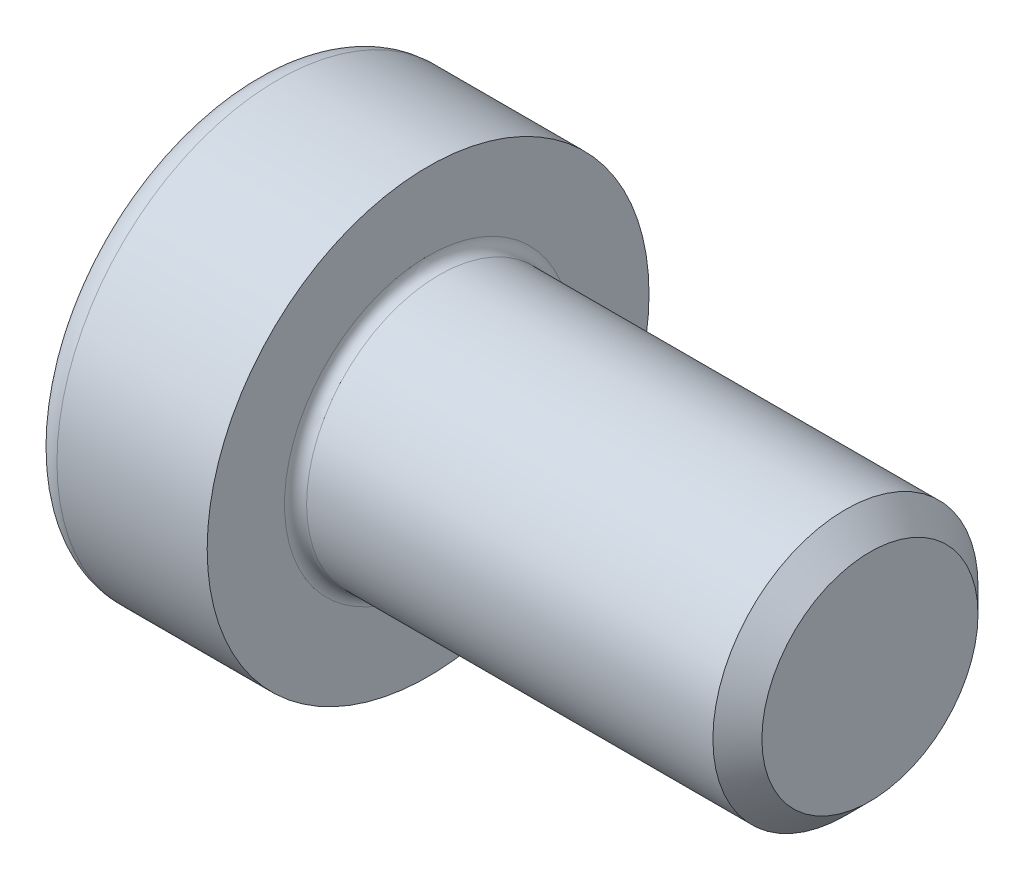
ISO-10303-21;
HEADER;
FILE_DESCRIPTION(('STEP AP214'),'2;1');
FILE_NAME('part.step','',(''),(''),'','','');
FILE_SCHEMA(('AUTOMOTIVE_DESIGN { 1 0 10303 214 1 1 1 1 }'));
ENDSEC;
DATA;
#1=APPLICATION_CONTEXT('core data for automotive mechanical design processes');
#2=APPLICATION_PROTOCOL_DEFINITION('international standard','automotive_design',2000,#1);
#3=PRODUCT_CONTEXT('',#1,'mechanical');
#4=PRODUCT('Part','Part','',(#3));
#5=PRODUCT_RELATED_PRODUCT_CATEGORY('part','',(#4));
#6=PRODUCT_DEFINITION_FORMATION('','',#4);
#7=PRODUCT_DEFINITION_CONTEXT('part definition',#1,'design');
#8=PRODUCT_DEFINITION('design','',#6,#7);
#9=PRODUCT_DEFINITION_SHAPE('','',#8);
#10=(LENGTH_UNIT() NAMED_UNIT(*) SI_UNIT(.MILLI.,.METRE.));
#11=(NAMED_UNIT(*) PLANE_ANGLE_UNIT() SI_UNIT($,.RADIAN.));
#12=(NAMED_UNIT(*) SI_UNIT($,.STERADIAN.) SOLID_ANGLE_UNIT());
#13=UNCERTAINTY_MEASURE_WITH_UNIT(LENGTH_MEASURE(1.E-05),#10,'distance_accuracy_value','');
#14=(GEOMETRIC_REPRESENTATION_CONTEXT(3) GLOBAL_UNCERTAINTY_ASSIGNED_CONTEXT((#13)) GLOBAL_UNIT_ASSIGNED_CONTEXT((#10,
#11,#12)) REPRESENTATION_CONTEXT('',''));
#15=CARTESIAN_POINT('',(0.,0.,0.));
#16=DIRECTION('',(0.,0.,1.));
#17=DIRECTION('',(1.,0.,0.));
#18=AXIS2_PLACEMENT_3D('',#15,#16,#17);
#19=CARTESIAN_POINT('',(0.,0.,0.));
#20=DIRECTION('',(-1.,0.,0.));
#21=DIRECTION('',(0.,0.,1.));
#22=AXIS2_PLACEMENT_3D('',#19,#20,#21);
#23=PLANE('',#22);
#24=DIRECTION('',(0.,-0.499999999999997,0.86602540378444));
#25=VECTOR('',#24,1.);
#26=CARTESIAN_POINT('',(0.,2.30940107675851,0.));
#27=LINE('',#26,#25);
#28=CARTESIAN_POINT('',(0.,2.30940107675851,0.));
#29=VERTEX_POINT('',#28);
#30=CARTESIAN_POINT('',(0.,1.15470053837926,1.99999999999999));
#31=VERTEX_POINT('',#30);
#32=EDGE_CURVE('E265',#29,#31,#27,.T.);
#33=ORIENTED_EDGE('',*,*,#32,.T.);
#34=DIRECTION('',(0.,1.,0.));
#35=VECTOR('',#34,1.);
#36=CARTESIAN_POINT('',(0.,-1.15470053837924,2.));
#37=LINE('',#36,#35);
#38=CARTESIAN_POINT('',(0.,-1.15470053837924,2.));
#39=VERTEX_POINT('',#38);
#40=EDGE_CURVE('E126',#39,#31,#37,.T.);
#41=ORIENTED_EDGE('',*,*,#40,.F.);
#42=DIRECTION('',(0.,-0.500000000000001,-0.866025403784438));
#43=VECTOR('',#42,1.);
#44=CARTESIAN_POINT('',(0.,-1.15470053837924,2.));
#45=LINE('',#44,#43);
#46=CARTESIAN_POINT('',(0.,-2.30940107675849,0.));
#47=VERTEX_POINT('',#46);
#48=EDGE_CURVE('E268',#39,#47,#45,.T.);
#49=ORIENTED_EDGE('',*,*,#48,.T.);
#50=DIRECTION('',(0.,0.499999999999997,-0.86602540378444));
#51=VECTOR('',#50,1.);
#52=CARTESIAN_POINT('',(0.,-2.30940107675849,0.));
#53=LINE('',#52,#51);
#54=CARTESIAN_POINT('',(0.,-1.15470053837925,-2.));
#55=VERTEX_POINT('',#54);
#56=EDGE_CURVE('E271',#47,#55,#53,.T.);
#57=ORIENTED_EDGE('',*,*,#56,.T.);
#58=DIRECTION('',(0.,-1.,0.));
#59=VECTOR('',#58,1.);
#60=CARTESIAN_POINT('',(0.,1.15470053837925,-2.00000000000001));
#61=LINE('',#60,#59);
#62=CARTESIAN_POINT('',(0.,1.15470053837925,-2.00000000000001));
#63=VERTEX_POINT('',#62);
#64=EDGE_CURVE('E274',#63,#55,#61,.T.);
#65=ORIENTED_EDGE('',*,*,#64,.F.);
#66=DIRECTION('',(0.,-0.500000000000001,-0.866025403784438));
#67=VECTOR('',#66,1.);
#68=CARTESIAN_POINT('',(0.,2.30940107675851,0.));
#69=LINE('',#68,#67);
#70=EDGE_CURVE('E121',#29,#63,#69,.T.);
#71=ORIENTED_EDGE('',*,*,#70,.F.);
#72=EDGE_LOOP('',(#33,#41,#49,#57,#65,#71));
#73=FACE_BOUND('',#72,.T.);
#74=CARTESIAN_POINT('',(0.,0.,0.));
#75=DIRECTION('',(-1.,0.,0.));
#76=DIRECTION('',(0.,0.,1.));
#77=AXIS2_PLACEMENT_3D('',#74,#75,#76);
#78=CIRCLE('',#77,4.4);
#79=CARTESIAN_POINT('',(0.,0.,4.4));
#80=VERTEX_POINT('',#79);
#81=EDGE_CURVE('E42',#80,#80,#78,.T.);
#82=ORIENTED_EDGE('',*,*,#81,.T.);
#83=EDGE_LOOP('',(#82));
#84=FACE_BOUND('',#83,.T.);
#85=ADVANCED_FACE('F34',(#73,#84),#23,.T.);
#86=CARTESIAN_POINT('',(-31.75,0.,0.));
#87=DIRECTION('',(-1.,0.,0.));
#88=DIRECTION('',(0.,0.,1.));
#89=AXIS2_PLACEMENT_3D('',#86,#87,#88);
#90=CYLINDRICAL_SURFACE('',#89,5.);
#91=CARTESIAN_POINT('',(0.600000000000003,0.,0.));
#92=DIRECTION('',(-1.,0.,0.));
#93=DIRECTION('',(0.,0.,1.));
#94=AXIS2_PLACEMENT_3D('',#91,#92,#93);
#95=CIRCLE('',#94,5.);
#96=CARTESIAN_POINT('',(0.600000000000003,0.,5.));
#97=VERTEX_POINT('',#96);
#98=EDGE_CURVE('E11',#97,#97,#95,.F.);
#99=ORIENTED_EDGE('',*,*,#98,.T.);
#100=EDGE_LOOP('',(#99));
#101=FACE_BOUND('',#100,.T.);
#102=CARTESIAN_POINT('',(4.,0.,0.));
#103=DIRECTION('',(-1.,0.,0.));
#104=DIRECTION('',(0.,0.,1.));
#105=AXIS2_PLACEMENT_3D('',#102,#103,#104);
#106=CIRCLE('',#105,5.);
#107=CARTESIAN_POINT('',(4.,0.,5.));
#108=VERTEX_POINT('',#107);
#109=EDGE_CURVE('E144',#108,#108,#106,.T.);
#110=ORIENTED_EDGE('',*,*,#109,.T.);
#111=EDGE_LOOP('',(#110));
#112=FACE_BOUND('',#111,.T.);
#113=ADVANCED_FACE('F168',(#101,#112),#90,.T.);
#114=CARTESIAN_POINT('',(4.,5.,0.));
#115=DIRECTION('',(1.,0.,0.));
#116=DIRECTION('',(0.,0.,-1.));
#117=AXIS2_PLACEMENT_3D('',#114,#115,#116);
#118=PLANE('',#117);
#119=CARTESIAN_POINT('',(4.,0.,0.));
#120=DIRECTION('',(1.,0.,0.));
#121=DIRECTION('',(0.,0.,-1.));
#122=AXIS2_PLACEMENT_3D('',#119,#120,#121);
#123=CIRCLE('',#122,3.24999999999998);
#124=CARTESIAN_POINT('',(4.,0.,-3.24999999999998));
#125=VERTEX_POINT('',#124);
#126=EDGE_CURVE('E147',#125,#125,#123,.F.);
#127=ORIENTED_EDGE('',*,*,#126,.T.);
#128=EDGE_LOOP('',(#127));
#129=FACE_BOUND('',#128,.T.);
#130=ORIENTED_EDGE('',*,*,#109,.F.);
#131=EDGE_LOOP('',(#130));
#132=FACE_BOUND('',#131,.T.);
#133=ADVANCED_FACE('F174',(#129,#132),#118,.T.);
#134=CARTESIAN_POINT('',(-31.75,0.,0.));
#135=DIRECTION('',(-1.,0.,0.));
#136=DIRECTION('',(0.,0.,1.));
#137=AXIS2_PLACEMENT_3D('',#134,#135,#136);
#138=CYLINDRICAL_SURFACE('',#137,2.99999999999998);
#139=CARTESIAN_POINT('',(4.25,0.,0.));
#140=DIRECTION('',(1.,0.,0.));
#141=DIRECTION('',(0.,0.,-1.));
#142=AXIS2_PLACEMENT_3D('',#139,#140,#141);
#143=CIRCLE('',#142,2.99999999999998);
#144=CARTESIAN_POINT('',(4.25,0.,-2.99999999999998));
#145=VERTEX_POINT('',#144);
#146=EDGE_CURVE('E150',#145,#145,#143,.T.);
#147=ORIENTED_EDGE('',*,*,#146,.T.);
#148=EDGE_LOOP('',(#147));
#149=FACE_BOUND('',#148,.T.);
#150=CARTESIAN_POINT('',(13.4455,0.,0.));
#151=DIRECTION('',(-1.,0.,0.));
#152=DIRECTION('',(0.,0.,1.));
#153=AXIS2_PLACEMENT_3D('',#150,#151,#152);
#154=CIRCLE('',#153,2.99999999999997);
#155=CARTESIAN_POINT('',(13.4455,0.,2.99999999999997));
#156=VERTEX_POINT('',#155);
#157=EDGE_CURVE('E141',#156,#156,#154,.T.);
#158=ORIENTED_EDGE('',*,*,#157,.T.);
#159=EDGE_LOOP('',(#158));
#160=FACE_BOUND('',#159,.T.);
#161=ADVANCED_FACE('F180',(#149,#160),#138,.T.);
#162=CARTESIAN_POINT('',(14.,0.,0.));
#163=DIRECTION('',(-1.,0.,0.));
#164=DIRECTION('',(0.,0.,1.));
#165=AXIS2_PLACEMENT_3D('',#162,#163,#164);
#166=CONICAL_SURFACE('',#165,2.4455,0.785398163397394);
#167=ORIENTED_EDGE('',*,*,#157,.F.);
#168=EDGE_LOOP('',(#167));
#169=FACE_BOUND('',#168,.T.);
#170=CARTESIAN_POINT('',(14.,0.,0.));
#171=DIRECTION('',(-1.,0.,0.));
#172=DIRECTION('',(0.,0.,1.));
#173=AXIS2_PLACEMENT_3D('',#170,#171,#172);
#174=CIRCLE('',#173,2.4455);
#175=CARTESIAN_POINT('',(14.,0.,2.4455));
#176=VERTEX_POINT('',#175);
#177=EDGE_CURVE('E137',#176,#176,#174,.T.);
#178=ORIENTED_EDGE('',*,*,#177,.T.);
#179=EDGE_LOOP('',(#178));
#180=FACE_BOUND('',#179,.T.);
#181=ADVANCED_FACE('F184',(#169,#180),#166,.T.);
#182=CARTESIAN_POINT('',(14.,2.4455,0.));
#183=DIRECTION('',(1.,0.,0.));
#184=DIRECTION('',(0.,0.,-1.));
#185=AXIS2_PLACEMENT_3D('',#182,#183,#184);
#186=PLANE('',#185);
#187=ORIENTED_EDGE('',*,*,#177,.F.);
#188=EDGE_LOOP('',(#187));
#189=FACE_BOUND('',#188,.T.);
#190=ADVANCED_FACE('F164',(#189),#186,.T.);
#191=CARTESIAN_POINT('',(4.25,0.,0.));
#192=DIRECTION('',(1.,0.,0.));
#193=DIRECTION('',(0.,0.,-1.));
#194=AXIS2_PLACEMENT_3D('',#191,#192,#193);
#195=TOROIDAL_SURFACE('',#194,3.24999999999998,0.25);
#196=ORIENTED_EDGE('',*,*,#146,.F.);
#197=EDGE_LOOP('',(#196));
#198=FACE_BOUND('',#197,.T.);
#199=ORIENTED_EDGE('',*,*,#126,.F.);
#200=EDGE_LOOP('',(#199));
#201=FACE_BOUND('',#200,.T.);
#202=ADVANCED_FACE('F157',(#198,#201),#195,.F.);
#203=CARTESIAN_POINT('',(0.600000000000003,0.,0.));
#204=DIRECTION('',(-1.,0.,0.));
#205=DIRECTION('',(0.,0.,1.));
#206=AXIS2_PLACEMENT_3D('',#203,#204,#205);
#207=TOROIDAL_SURFACE('',#206,4.4,0.6);
#208=ORIENTED_EDGE('',*,*,#98,.F.);
#209=EDGE_LOOP('',(#208));
#210=FACE_BOUND('',#209,.T.);
#211=ORIENTED_EDGE('',*,*,#81,.F.);
#212=EDGE_LOOP('',(#211));
#213=FACE_BOUND('',#212,.T.);
#214=ADVANCED_FACE('F36',(#210,#213),#207,.T.);
#215=CARTESIAN_POINT('',(3.,2.30940107675851,0.));
#216=DIRECTION('',(0.,-0.86602540378444,-0.499999999999998));
#217=DIRECTION('',(0.,0.499999999999998,-0.86602540378444));
#218=AXIS2_PLACEMENT_3D('',#215,#216,#217);
#219=PLANE('',#218);
#220=ORIENTED_EDGE('',*,*,#32,.F.);
#221=DIRECTION('',(-1.,0.,0.));
#222=VECTOR('',#221,1.);
#223=CARTESIAN_POINT('',(3.,2.30940107675851,0.));
#224=LINE('',#223,#222);
#225=CARTESIAN_POINT('',(3.,2.30940107675851,0.));
#226=VERTEX_POINT('',#225);
#227=EDGE_CURVE('E264',#226,#29,#224,.T.);
#228=ORIENTED_EDGE('',*,*,#227,.F.);
#229=DIRECTION('',(0.,-0.499999999999997,0.86602540378444));
#230=VECTOR('',#229,1.);
#231=CARTESIAN_POINT('',(3.,2.30940107675851,0.));
#232=LINE('',#231,#230);
#233=CARTESIAN_POINT('',(3.,1.73205080756888,0.999999999999995));
#234=VERTEX_POINT('',#233);
#235=EDGE_CURVE('E49',#226,#234,#232,.T.);
#236=ORIENTED_EDGE('',*,*,#235,.T.);
#237=CARTESIAN_POINT('',(3.,1.15470053837926,1.99999999999999));
#238=VERTEX_POINT('',#237);
#239=EDGE_CURVE('E107',#234,#238,#232,.T.);
#240=ORIENTED_EDGE('',*,*,#239,.T.);
#241=DIRECTION('',(-1.,0.,0.));
#242=VECTOR('',#241,1.);
#243=CARTESIAN_POINT('',(3.,1.15470053837926,1.99999999999999));
#244=LINE('',#243,#242);
#245=EDGE_CURVE('E119',#238,#31,#244,.T.);
#246=ORIENTED_EDGE('',*,*,#245,.T.);
#247=EDGE_LOOP('',(#220,#228,#236,#240,#246));
#248=FACE_BOUND('',#247,.T.);
#249=ADVANCED_FACE('F118',(#248),#219,.T.);
#250=CARTESIAN_POINT('',(3.,-1.15470053837924,2.));
#251=DIRECTION('',(0.,0.,1.));
#252=DIRECTION('',(0.,-1.,0.));
#253=AXIS2_PLACEMENT_3D('',#250,#251,#252);
#254=PLANE('',#253);
#255=ORIENTED_EDGE('',*,*,#40,.T.);
#256=ORIENTED_EDGE('',*,*,#245,.F.);
#257=DIRECTION('',(0.,1.,0.));
#258=VECTOR('',#257,1.);
#259=CARTESIAN_POINT('',(3.,-1.15470053837924,2.));
#260=LINE('',#259,#258);
#261=CARTESIAN_POINT('',(3.,0.,2.));
#262=VERTEX_POINT('',#261);
#263=EDGE_CURVE('E105',#262,#238,#260,.T.);
#264=ORIENTED_EDGE('',*,*,#263,.F.);
#265=CARTESIAN_POINT('',(3.,-1.15470053837924,2.));
#266=VERTEX_POINT('',#265);
#267=EDGE_CURVE('E115',#266,#262,#260,.T.);
#268=ORIENTED_EDGE('',*,*,#267,.F.);
#269=DIRECTION('',(-1.,0.,0.));
#270=VECTOR('',#269,1.);
#271=CARTESIAN_POINT('',(3.,-1.15470053837924,2.));
#272=LINE('',#271,#270);
#273=EDGE_CURVE('E128',#266,#39,#272,.T.);
#274=ORIENTED_EDGE('',*,*,#273,.T.);
#275=EDGE_LOOP('',(#255,#256,#264,#268,#274));
#276=FACE_BOUND('',#275,.T.);
#277=ADVANCED_FACE('F123',(#276),#254,.F.);
#278=CARTESIAN_POINT('',(3.,-1.15470053837924,2.));
#279=DIRECTION('',(0.,0.866025403784438,-0.500000000000001));
#280=DIRECTION('',(0.,0.500000000000001,0.866025403784438));
#281=AXIS2_PLACEMENT_3D('',#278,#279,#280);
#282=PLANE('',#281);
#283=ORIENTED_EDGE('',*,*,#48,.F.);
#284=ORIENTED_EDGE('',*,*,#273,.F.);
#285=DIRECTION('',(0.,-0.500000000000001,-0.866025403784438));
#286=VECTOR('',#285,1.);
#287=CARTESIAN_POINT('',(3.,-1.15470053837924,2.));
#288=LINE('',#287,#286);
#289=CARTESIAN_POINT('',(3.,-1.73205080756887,0.999999999999997));
#290=VERTEX_POINT('',#289);
#291=EDGE_CURVE('E245',#266,#290,#288,.T.);
#292=ORIENTED_EDGE('',*,*,#291,.T.);
#293=CARTESIAN_POINT('',(3.,-2.30940107675849,0.));
#294=VERTEX_POINT('',#293);
#295=EDGE_CURVE('E247',#290,#294,#288,.T.);
#296=ORIENTED_EDGE('',*,*,#295,.T.);
#297=DIRECTION('',(-1.,0.,0.));
#298=VECTOR('',#297,1.);
#299=CARTESIAN_POINT('',(3.,-2.30940107675849,0.));
#300=LINE('',#299,#298);
#301=EDGE_CURVE('E133',#294,#47,#300,.T.);
#302=ORIENTED_EDGE('',*,*,#301,.T.);
#303=EDGE_LOOP('',(#283,#284,#292,#296,#302));
#304=FACE_BOUND('',#303,.T.);
#305=ADVANCED_FACE('F197',(#304),#282,.T.);
#306=CARTESIAN_POINT('',(3.,-2.30940107675849,0.));
#307=DIRECTION('',(0.,0.86602540378444,0.499999999999998));
#308=DIRECTION('',(0.,-0.499999999999998,0.86602540378444));
#309=AXIS2_PLACEMENT_3D('',#306,#307,#308);
#310=PLANE('',#309);
#311=ORIENTED_EDGE('',*,*,#56,.F.);
#312=ORIENTED_EDGE('',*,*,#301,.F.);
#313=DIRECTION('',(0.,0.499999999999997,-0.86602540378444));
#314=VECTOR('',#313,1.);
#315=CARTESIAN_POINT('',(3.,-2.30940107675849,0.));
#316=LINE('',#315,#314);
#317=CARTESIAN_POINT('',(3.,-1.73205080756888,-0.999999999999993));
#318=VERTEX_POINT('',#317);
#319=EDGE_CURVE('E250',#294,#318,#316,.T.);
#320=ORIENTED_EDGE('',*,*,#319,.T.);
#321=CARTESIAN_POINT('',(3.,-1.15470053837925,-2.));
#322=VERTEX_POINT('',#321);
#323=EDGE_CURVE('E254',#318,#322,#316,.T.);
#324=ORIENTED_EDGE('',*,*,#323,.T.);
#325=DIRECTION('',(-1.,0.,0.));
#326=VECTOR('',#325,1.);
#327=CARTESIAN_POINT('',(3.,-1.15470053837925,-2.));
#328=LINE('',#327,#326);
#329=EDGE_CURVE('E283',#322,#55,#328,.T.);
#330=ORIENTED_EDGE('',*,*,#329,.T.);
#331=EDGE_LOOP('',(#311,#312,#320,#324,#330));
#332=FACE_BOUND('',#331,.T.);
#333=ADVANCED_FACE('F200',(#332),#310,.T.);
#334=CARTESIAN_POINT('',(3.,1.15470053837925,-2.00000000000001));
#335=DIRECTION('',(0.,0.,-1.));
#336=DIRECTION('',(0.,1.,0.));
#337=AXIS2_PLACEMENT_3D('',#334,#335,#336);
#338=PLANE('',#337);
#339=ORIENTED_EDGE('',*,*,#64,.T.);
#340=ORIENTED_EDGE('',*,*,#329,.F.);
#341=DIRECTION('',(0.,-1.,0.));
#342=VECTOR('',#341,1.);
#343=CARTESIAN_POINT('',(3.,1.15470053837925,-2.00000000000001));
#344=LINE('',#343,#342);
#345=CARTESIAN_POINT('',(3.,0.,-2.00000000000001));
#346=VERTEX_POINT('',#345);
#347=EDGE_CURVE('E258',#346,#322,#344,.T.);
#348=ORIENTED_EDGE('',*,*,#347,.F.);
#349=CARTESIAN_POINT('',(3.,1.15470053837925,-2.00000000000001));
#350=VERTEX_POINT('',#349);
#351=EDGE_CURVE('E259',#350,#346,#344,.T.);
#352=ORIENTED_EDGE('',*,*,#351,.F.);
#353=DIRECTION('',(-1.,0.,0.));
#354=VECTOR('',#353,1.);
#355=CARTESIAN_POINT('',(3.,1.15470053837925,-2.00000000000001));
#356=LINE('',#355,#354);
#357=EDGE_CURVE('E280',#350,#63,#356,.T.);
#358=ORIENTED_EDGE('',*,*,#357,.T.);
#359=EDGE_LOOP('',(#339,#340,#348,#352,#358));
#360=FACE_BOUND('',#359,.T.);
#361=ADVANCED_FACE('F204',(#360),#338,.F.);
#362=CARTESIAN_POINT('',(3.,2.30940107675851,0.));
#363=DIRECTION('',(0.,0.866025403784438,-0.500000000000001));
#364=DIRECTION('',(0.,0.500000000000001,0.866025403784438));
#365=AXIS2_PLACEMENT_3D('',#362,#363,#364);
#366=PLANE('',#365);
#367=ORIENTED_EDGE('',*,*,#70,.T.);
#368=ORIENTED_EDGE('',*,*,#357,.F.);
#369=DIRECTION('',(0.,-0.500000000000001,-0.866025403784438));
#370=VECTOR('',#369,1.);
#371=CARTESIAN_POINT('',(3.,2.30940107675851,0.));
#372=LINE('',#371,#370);
#373=CARTESIAN_POINT('',(3.,1.73205080756888,-1.00000000000001));
#374=VERTEX_POINT('',#373);
#375=EDGE_CURVE('E262',#374,#350,#372,.T.);
#376=ORIENTED_EDGE('',*,*,#375,.F.);
#377=EDGE_CURVE('E236',#226,#374,#372,.T.);
#378=ORIENTED_EDGE('',*,*,#377,.F.);
#379=ORIENTED_EDGE('',*,*,#227,.T.);
#380=EDGE_LOOP('',(#367,#368,#376,#378,#379));
#381=FACE_BOUND('',#380,.T.);
#382=ADVANCED_FACE('F208',(#381),#366,.F.);
#383=CARTESIAN_POINT('',(3.,1.15470053837926,1.99999999999999));
#384=DIRECTION('',(-1.,0.,0.));
#385=DIRECTION('',(0.,0.,1.));
#386=AXIS2_PLACEMENT_3D('',#383,#384,#385);
#387=PLANE('',#386);
#388=CARTESIAN_POINT('',(3.,0.,0.));
#389=DIRECTION('',(-1.,0.,0.));
#390=DIRECTION('',(0.,0.,1.));
#391=AXIS2_PLACEMENT_3D('',#388,#389,#390);
#392=CIRCLE('',#391,2.);
#393=EDGE_CURVE('E127',#290,#262,#392,.T.);
#394=ORIENTED_EDGE('',*,*,#393,.F.);
#395=ORIENTED_EDGE('',*,*,#291,.F.);
#396=ORIENTED_EDGE('',*,*,#267,.T.);
#397=EDGE_LOOP('',(#394,#395,#396));
#398=FACE_BOUND('',#397,.T.);
#399=ADVANCED_FACE('F212',(#398),#387,.T.);
#400=EDGE_CURVE('E131',#318,#290,#392,.T.);
#401=ORIENTED_EDGE('',*,*,#400,.F.);
#402=ORIENTED_EDGE('',*,*,#319,.F.);
#403=ORIENTED_EDGE('',*,*,#295,.F.);
#404=EDGE_LOOP('',(#401,#402,#403));
#405=FACE_BOUND('',#404,.T.);
#406=ADVANCED_FACE('F215',(#405),#387,.T.);
#407=EDGE_CURVE('E289',#346,#318,#392,.T.);
#408=ORIENTED_EDGE('',*,*,#407,.F.);
#409=ORIENTED_EDGE('',*,*,#347,.T.);
#410=ORIENTED_EDGE('',*,*,#323,.F.);
#411=EDGE_LOOP('',(#408,#409,#410));
#412=FACE_BOUND('',#411,.T.);
#413=ADVANCED_FACE('F220',(#412),#387,.T.);
#414=EDGE_CURVE('E239',#374,#346,#392,.T.);
#415=ORIENTED_EDGE('',*,*,#414,.F.);
#416=ORIENTED_EDGE('',*,*,#375,.T.);
#417=ORIENTED_EDGE('',*,*,#351,.T.);
#418=EDGE_LOOP('',(#415,#416,#417));
#419=FACE_BOUND('',#418,.T.);
#420=ADVANCED_FACE('F227',(#419),#387,.T.);
#421=EDGE_CURVE('E138',#234,#374,#392,.T.);
#422=ORIENTED_EDGE('',*,*,#421,.F.);
#423=ORIENTED_EDGE('',*,*,#235,.F.);
#424=ORIENTED_EDGE('',*,*,#377,.T.);
#425=EDGE_LOOP('',(#422,#423,#424));
#426=FACE_BOUND('',#425,.T.);
#427=ADVANCED_FACE('F223',(#426),#387,.T.);
#428=EDGE_CURVE('E110',#262,#234,#392,.T.);
#429=ORIENTED_EDGE('',*,*,#428,.F.);
#430=ORIENTED_EDGE('',*,*,#263,.T.);
#431=ORIENTED_EDGE('',*,*,#239,.F.);
#432=EDGE_LOOP('',(#429,#430,#431));
#433=FACE_BOUND('',#432,.T.);
#434=ADVANCED_FACE('F106',(#433),#387,.T.);
#435=CARTESIAN_POINT('',(3.,0.,0.));
#436=DIRECTION('',(-1.,0.,0.));
#437=DIRECTION('',(0.,0.,1.));
#438=AXIS2_PLACEMENT_3D('',#435,#436,#437);
#439=CONICAL_SURFACE('',#438,2.,1.04719755119659);
#440=CARTESIAN_POINT('',(4.15470053837927,0.,0.));
#441=VERTEX_POINT('',#440);
#442=VERTEX_LOOP('',#441);
#443=FACE_BOUND('',#442,.T.);
#444=ORIENTED_EDGE('',*,*,#428,.T.);
#445=ORIENTED_EDGE('',*,*,#421,.T.);
#446=ORIENTED_EDGE('',*,*,#414,.T.);
#447=ORIENTED_EDGE('',*,*,#407,.T.);
#448=ORIENTED_EDGE('',*,*,#400,.T.);
#449=ORIENTED_EDGE('',*,*,#393,.T.);
#450=EDGE_LOOP('',(#444,#445,#446,#447,#448,#449));
#451=FACE_BOUND('',#450,.T.);
#452=ADVANCED_FACE('F192',(#443,#451),#439,.F.);
#453=CLOSED_SHELL('',(#85,#113,#133,#161,#181,#190,#202,#214,#249,#277,#305,#333,#361,#382,#399,
#406,#413,#420,#427,#434,#452));
#454=MANIFOLD_SOLID_BREP('B2',#453);
#455=ADVANCED_BREP_SHAPE_REPRESENTATION('',(#18,#454),#14);
#456=SHAPE_DEFINITION_REPRESENTATION(#9,#455);
ENDSEC;
END-ISO-10303-21;
